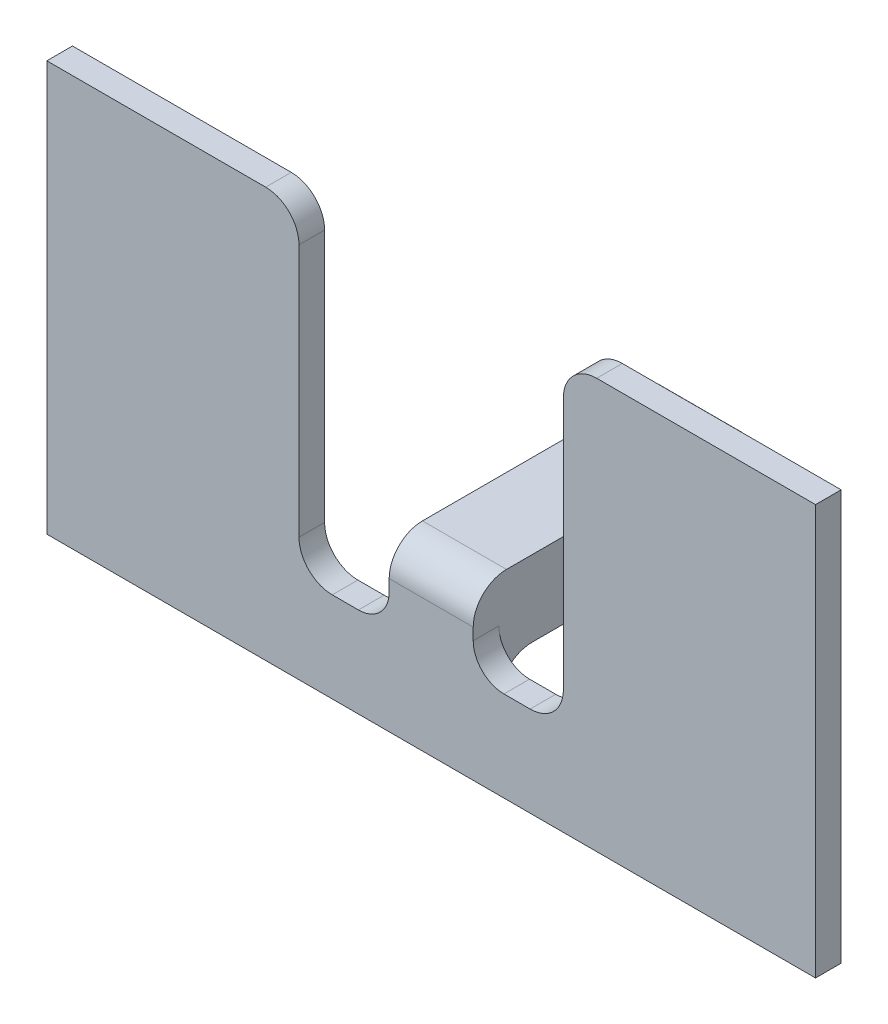
ISO-10303-21;
HEADER;
FILE_DESCRIPTION(('STEP AP214'),'2;1');
FILE_NAME('part.step','',(''),(''),'','','');
FILE_SCHEMA(('AUTOMOTIVE_DESIGN { 1 0 10303 214 1 1 1 1 }'));
ENDSEC;
DATA;
#1=APPLICATION_CONTEXT('core data for automotive mechanical design processes');
#2=APPLICATION_PROTOCOL_DEFINITION('international standard','automotive_design',2000,#1);
#3=PRODUCT_CONTEXT('',#1,'mechanical');
#4=PRODUCT('Part','Part','',(#3));
#5=PRODUCT_RELATED_PRODUCT_CATEGORY('part','',(#4));
#6=PRODUCT_DEFINITION_FORMATION('','',#4);
#7=PRODUCT_DEFINITION_CONTEXT('part definition',#1,'design');
#8=PRODUCT_DEFINITION('design','',#6,#7);
#9=PRODUCT_DEFINITION_SHAPE('','',#8);
#10=(LENGTH_UNIT() NAMED_UNIT(*) SI_UNIT(.MILLI.,.METRE.));
#11=(NAMED_UNIT(*) PLANE_ANGLE_UNIT() SI_UNIT($,.RADIAN.));
#12=(NAMED_UNIT(*) SI_UNIT($,.STERADIAN.) SOLID_ANGLE_UNIT());
#13=UNCERTAINTY_MEASURE_WITH_UNIT(LENGTH_MEASURE(1.E-05),#10,'distance_accuracy_value','');
#14=(GEOMETRIC_REPRESENTATION_CONTEXT(3) GLOBAL_UNCERTAINTY_ASSIGNED_CONTEXT((#13)) GLOBAL_UNIT_ASSIGNED_CONTEXT((#10,
#11,#12)) REPRESENTATION_CONTEXT('',''));
#15=CARTESIAN_POINT('',(0.,0.,0.));
#16=DIRECTION('',(0.,0.,1.));
#17=DIRECTION('',(1.,0.,0.));
#18=AXIS2_PLACEMENT_3D('',#15,#16,#17);
#19=CARTESIAN_POINT('',(-37.5000000000001,20.,2.5));
#20=DIRECTION('',(0.,-1.,0.));
#21=DIRECTION('',(0.,0.,-1.));
#22=AXIS2_PLACEMENT_3D('',#19,#20,#21);
#23=PLANE('',#22);
#24=DIRECTION('',(-1.,0.,0.));
#25=VECTOR('',#24,1.);
#26=CARTESIAN_POINT('',(-37.5000000000001,20.,2.5));
#27=LINE('',#26,#25);
#28=CARTESIAN_POINT('',(-16.15,20.,2.5));
#29=VERTEX_POINT('',#28);
#30=CARTESIAN_POINT('',(-37.5000000000001,20.,2.5));
#31=VERTEX_POINT('',#30);
#32=EDGE_CURVE('E314',#29,#31,#27,.T.);
#33=ORIENTED_EDGE('',*,*,#32,.F.);
#34=DIRECTION('',(0.,0.,-1.));
#35=VECTOR('',#34,1.);
#36=CARTESIAN_POINT('',(-16.15,20.,0.));
#37=LINE('',#36,#35);
#38=CARTESIAN_POINT('',(-16.15,20.,0.));
#39=VERTEX_POINT('',#38);
#40=EDGE_CURVE('E355',#29,#39,#37,.T.);
#41=ORIENTED_EDGE('',*,*,#40,.T.);
#42=DIRECTION('',(-1.,0.,0.));
#43=VECTOR('',#42,1.);
#44=CARTESIAN_POINT('',(-37.5000000000001,20.,0.));
#45=LINE('',#44,#43);
#46=CARTESIAN_POINT('',(-37.5000000000001,20.,0.));
#47=VERTEX_POINT('',#46);
#48=EDGE_CURVE('E330',#39,#47,#45,.T.);
#49=ORIENTED_EDGE('',*,*,#48,.T.);
#50=DIRECTION('',(0.,0.,-1.));
#51=VECTOR('',#50,1.);
#52=CARTESIAN_POINT('',(-37.5000000000001,20.,2.5));
#53=LINE('',#52,#51);
#54=EDGE_CURVE('E347',#31,#47,#53,.T.);
#55=ORIENTED_EDGE('',*,*,#54,.F.);
#56=EDGE_LOOP('',(#33,#41,#49,#55));
#57=FACE_BOUND('',#56,.T.);
#58=ADVANCED_FACE('F49',(#57),#23,.F.);
#59=CARTESIAN_POINT('',(37.5000000000001,-20.,2.5));
#60=DIRECTION('',(-1.,0.,0.));
#61=DIRECTION('',(0.,0.,1.));
#62=AXIS2_PLACEMENT_3D('',#59,#60,#61);
#63=PLANE('',#62);
#64=DIRECTION('',(0.,1.,0.));
#65=VECTOR('',#64,1.);
#66=CARTESIAN_POINT('',(37.5000000000001,-20.,0.));
#67=LINE('',#66,#65);
#68=CARTESIAN_POINT('',(37.5000000000001,-20.,0.));
#69=VERTEX_POINT('',#68);
#70=CARTESIAN_POINT('',(37.5000000000001,20.,0.));
#71=VERTEX_POINT('',#70);
#72=EDGE_CURVE('E309',#69,#71,#67,.T.);
#73=ORIENTED_EDGE('',*,*,#72,.T.);
#74=DIRECTION('',(0.,0.,-1.));
#75=VECTOR('',#74,1.);
#76=CARTESIAN_POINT('',(37.5000000000001,20.,2.5));
#77=LINE('',#76,#75);
#78=CARTESIAN_POINT('',(37.5000000000001,20.,2.5));
#79=VERTEX_POINT('',#78);
#80=EDGE_CURVE('E351',#79,#71,#77,.T.);
#81=ORIENTED_EDGE('',*,*,#80,.F.);
#82=DIRECTION('',(0.,1.,0.));
#83=VECTOR('',#82,1.);
#84=CARTESIAN_POINT('',(37.5000000000001,-20.,2.5));
#85=LINE('',#84,#83);
#86=CARTESIAN_POINT('',(37.5000000000001,-20.,2.5));
#87=VERTEX_POINT('',#86);
#88=EDGE_CURVE('E310',#87,#79,#85,.T.);
#89=ORIENTED_EDGE('',*,*,#88,.F.);
#90=DIRECTION('',(0.,0.,-1.));
#91=VECTOR('',#90,1.);
#92=CARTESIAN_POINT('',(37.5000000000001,-20.,2.5));
#93=LINE('',#92,#91);
#94=EDGE_CURVE('E326',#87,#69,#93,.T.);
#95=ORIENTED_EDGE('',*,*,#94,.T.);
#96=EDGE_LOOP('',(#73,#81,#89,#95));
#97=FACE_BOUND('',#96,.T.);
#98=ADVANCED_FACE('F515',(#97),#63,.F.);
#99=CARTESIAN_POINT('',(16.15,20.,0.));
#100=VERTEX_POINT('',#99);
#101=EDGE_CURVE('E331',#71,#100,#45,.T.);
#102=ORIENTED_EDGE('',*,*,#101,.T.);
#103=DIRECTION('',(0.,0.,-1.));
#104=VECTOR('',#103,1.);
#105=CARTESIAN_POINT('',(16.15,20.,2.5));
#106=LINE('',#105,#104);
#107=CARTESIAN_POINT('',(16.15,20.,2.5));
#108=VERTEX_POINT('',#107);
#109=EDGE_CURVE('E427',#100,#108,#106,.F.);
#110=ORIENTED_EDGE('',*,*,#109,.T.);
#111=EDGE_CURVE('E316',#79,#108,#27,.T.);
#112=ORIENTED_EDGE('',*,*,#111,.F.);
#113=ORIENTED_EDGE('',*,*,#80,.T.);
#114=EDGE_LOOP('',(#102,#110,#112,#113));
#115=FACE_BOUND('',#114,.T.);
#116=ADVANCED_FACE('F572',(#115),#23,.F.);
#117=CARTESIAN_POINT('',(-37.5000000000001,-20.,2.5));
#118=DIRECTION('',(1.,0.,0.));
#119=DIRECTION('',(0.,0.,-1.));
#120=AXIS2_PLACEMENT_3D('',#117,#118,#119);
#121=PLANE('',#120);
#122=DIRECTION('',(0.,-1.,0.));
#123=VECTOR('',#122,1.);
#124=CARTESIAN_POINT('',(-37.5000000000001,-20.,0.));
#125=LINE('',#124,#123);
#126=CARTESIAN_POINT('',(-37.5000000000001,-20.,0.));
#127=VERTEX_POINT('',#126);
#128=EDGE_CURVE('E335',#47,#127,#125,.T.);
#129=ORIENTED_EDGE('',*,*,#128,.T.);
#130=DIRECTION('',(0.,0.,-1.));
#131=VECTOR('',#130,1.);
#132=CARTESIAN_POINT('',(-37.5000000000001,-20.,2.5));
#133=LINE('',#132,#131);
#134=CARTESIAN_POINT('',(-37.5000000000001,-20.,2.5));
#135=VERTEX_POINT('',#134);
#136=EDGE_CURVE('E343',#135,#127,#133,.T.);
#137=ORIENTED_EDGE('',*,*,#136,.F.);
#138=DIRECTION('',(0.,-1.,0.));
#139=VECTOR('',#138,1.);
#140=CARTESIAN_POINT('',(-37.5000000000001,-20.,2.5));
#141=LINE('',#140,#139);
#142=EDGE_CURVE('E320',#31,#135,#141,.T.);
#143=ORIENTED_EDGE('',*,*,#142,.F.);
#144=ORIENTED_EDGE('',*,*,#54,.T.);
#145=EDGE_LOOP('',(#129,#137,#143,#144));
#146=FACE_BOUND('',#145,.T.);
#147=ADVANCED_FACE('F505',(#146),#121,.F.);
#148=CARTESIAN_POINT('',(-37.5000000000001,-20.,2.5));
#149=DIRECTION('',(0.,1.,0.));
#150=DIRECTION('',(0.,0.,1.));
#151=AXIS2_PLACEMENT_3D('',#148,#149,#150);
#152=PLANE('',#151);
#153=DIRECTION('',(1.,0.,0.));
#154=VECTOR('',#153,1.);
#155=CARTESIAN_POINT('',(-37.5000000000001,-20.,0.));
#156=LINE('',#155,#154);
#157=EDGE_CURVE('E315',#127,#69,#156,.T.);
#158=ORIENTED_EDGE('',*,*,#157,.T.);
#159=ORIENTED_EDGE('',*,*,#94,.F.);
#160=DIRECTION('',(1.,0.,0.));
#161=VECTOR('',#160,1.);
#162=CARTESIAN_POINT('',(-37.5000000000001,-20.,2.5));
#163=LINE('',#162,#161);
#164=EDGE_CURVE('E323',#135,#87,#163,.T.);
#165=ORIENTED_EDGE('',*,*,#164,.F.);
#166=ORIENTED_EDGE('',*,*,#136,.T.);
#167=EDGE_LOOP('',(#158,#159,#165,#166));
#168=FACE_BOUND('',#167,.T.);
#169=ADVANCED_FACE('F511',(#168),#152,.F.);
#170=CARTESIAN_POINT('',(0.,0.,2.5));
#171=DIRECTION('',(0.,0.,-1.));
#172=DIRECTION('',(-1.,0.,0.));
#173=AXIS2_PLACEMENT_3D('',#170,#171,#172);
#174=PLANE('',#173);
#175=DIRECTION('',(0.,-1.,0.));
#176=VECTOR('',#175,1.);
#177=CARTESIAN_POINT('',(-12.9,0.,2.5));
#178=LINE('',#177,#176);
#179=CARTESIAN_POINT('',(-12.9,16.75,2.5));
#180=VERTEX_POINT('',#179);
#181=CARTESIAN_POINT('',(-12.9,-7.95,2.5));
#182=VERTEX_POINT('',#181);
#183=EDGE_CURVE('E256',#180,#182,#178,.T.);
#184=ORIENTED_EDGE('',*,*,#183,.F.);
#185=CARTESIAN_POINT('',(-16.15,16.75,2.5));
#186=DIRECTION('',(0.,0.,-1.));
#187=DIRECTION('',(-1.,0.,0.));
#188=AXIS2_PLACEMENT_3D('',#185,#186,#187);
#189=CIRCLE('',#188,3.25);
#190=EDGE_CURVE('E388',#180,#29,#189,.F.);
#191=ORIENTED_EDGE('',*,*,#190,.T.);
#192=ORIENTED_EDGE('',*,*,#32,.T.);
#193=ORIENTED_EDGE('',*,*,#142,.T.);
#194=ORIENTED_EDGE('',*,*,#164,.T.);
#195=ORIENTED_EDGE('',*,*,#88,.T.);
#196=ORIENTED_EDGE('',*,*,#111,.T.);
#197=CARTESIAN_POINT('',(16.15,16.75,2.5));
#198=DIRECTION('',(0.,0.,-1.));
#199=DIRECTION('',(-1.,0.,0.));
#200=AXIS2_PLACEMENT_3D('',#197,#198,#199);
#201=CIRCLE('',#200,3.25);
#202=CARTESIAN_POINT('',(12.9,16.75,2.5));
#203=VERTEX_POINT('',#202);
#204=EDGE_CURVE('E381',#108,#203,#201,.F.);
#205=ORIENTED_EDGE('',*,*,#204,.T.);
#206=DIRECTION('',(0.,-1.,0.));
#207=VECTOR('',#206,1.);
#208=CARTESIAN_POINT('',(12.9,0.,2.5));
#209=LINE('',#208,#207);
#210=CARTESIAN_POINT('',(12.9,-7.95,2.5));
#211=VERTEX_POINT('',#210);
#212=EDGE_CURVE('E292',#203,#211,#209,.T.);
#213=ORIENTED_EDGE('',*,*,#212,.T.);
#214=CARTESIAN_POINT('',(9.65,-7.95,2.5));
#215=DIRECTION('',(0.,0.,-1.));
#216=DIRECTION('',(-1.,0.,0.));
#217=AXIS2_PLACEMENT_3D('',#214,#215,#216);
#218=CIRCLE('',#217,3.25);
#219=CARTESIAN_POINT('',(9.65,-11.2,2.5));
#220=VERTEX_POINT('',#219);
#221=EDGE_CURVE('E448',#211,#220,#218,.T.);
#222=ORIENTED_EDGE('',*,*,#221,.T.);
#223=DIRECTION('',(-1.,0.,0.));
#224=VECTOR('',#223,1.);
#225=CARTESIAN_POINT('',(0.,-11.2,2.5));
#226=LINE('',#225,#224);
#227=CARTESIAN_POINT('',(7.1,-11.2,2.5));
#228=VERTEX_POINT('',#227);
#229=EDGE_CURVE('E296',#220,#228,#226,.T.);
#230=ORIENTED_EDGE('',*,*,#229,.T.);
#231=CARTESIAN_POINT('',(7.1,-8.2,2.5));
#232=DIRECTION('',(0.,0.,-1.));
#233=DIRECTION('',(-1.,0.,0.));
#234=AXIS2_PLACEMENT_3D('',#231,#232,#233);
#235=CIRCLE('',#234,3.);
#236=CARTESIAN_POINT('',(4.1,-8.2,2.5));
#237=VERTEX_POINT('',#236);
#238=EDGE_CURVE('E467',#228,#237,#235,.T.);
#239=ORIENTED_EDGE('',*,*,#238,.T.);
#240=DIRECTION('',(0.,1.,0.));
#241=VECTOR('',#240,1.);
#242=CARTESIAN_POINT('',(4.1,0.,2.5));
#243=LINE('',#242,#241);
#244=CARTESIAN_POINT('',(4.1,-7.05,2.5));
#245=VERTEX_POINT('',#244);
#246=EDGE_CURVE('E300',#237,#245,#243,.T.);
#247=ORIENTED_EDGE('',*,*,#246,.T.);
#248=DIRECTION('',(-1.,0.,0.));
#249=VECTOR('',#248,1.);
#250=CARTESIAN_POINT('',(0.,-7.05,2.5));
#251=LINE('',#250,#249);
#252=CARTESIAN_POINT('',(-4.1,-7.05,2.5));
#253=VERTEX_POINT('',#252);
#254=EDGE_CURVE('E384',#245,#253,#251,.T.);
#255=ORIENTED_EDGE('',*,*,#254,.T.);
#256=DIRECTION('',(0.,1.,0.));
#257=VECTOR('',#256,1.);
#258=CARTESIAN_POINT('',(-4.1,0.,2.5));
#259=LINE('',#258,#257);
#260=CARTESIAN_POINT('',(-4.1,-8.2,2.5));
#261=VERTEX_POINT('',#260);
#262=EDGE_CURVE('E303',#261,#253,#259,.T.);
#263=ORIENTED_EDGE('',*,*,#262,.F.);
#264=CARTESIAN_POINT('',(-7.1,-8.2,2.5));
#265=DIRECTION('',(0.,0.,-1.));
#266=DIRECTION('',(-1.,0.,0.));
#267=AXIS2_PLACEMENT_3D('',#264,#265,#266);
#268=CIRCLE('',#267,3.);
#269=CARTESIAN_POINT('',(-7.1,-11.2,2.5));
#270=VERTEX_POINT('',#269);
#271=EDGE_CURVE('E11',#261,#270,#268,.T.);
#272=ORIENTED_EDGE('',*,*,#271,.T.);
#273=DIRECTION('',(-1.,0.,0.));
#274=VECTOR('',#273,1.);
#275=CARTESIAN_POINT('',(0.,-11.2,2.5));
#276=LINE('',#275,#274);
#277=CARTESIAN_POINT('',(-9.65,-11.2,2.5));
#278=VERTEX_POINT('',#277);
#279=EDGE_CURVE('E306',#270,#278,#276,.T.);
#280=ORIENTED_EDGE('',*,*,#279,.T.);
#281=CARTESIAN_POINT('',(-9.65,-7.95,2.5));
#282=DIRECTION('',(0.,0.,-1.));
#283=DIRECTION('',(-1.,0.,0.));
#284=AXIS2_PLACEMENT_3D('',#281,#282,#283);
#285=CIRCLE('',#284,3.25);
#286=EDGE_CURVE('E436',#278,#182,#285,.T.);
#287=ORIENTED_EDGE('',*,*,#286,.T.);
#288=EDGE_LOOP('',(#184,#191,#192,#193,#194,#195,#196,#205,#213,#222,#230,#239,#247,#255,#263,
#272,#280,#287));
#289=FACE_BOUND('',#288,.T.);
#290=ADVANCED_FACE('F481',(#289),#174,.F.);
#291=CARTESIAN_POINT('',(0.,0.,0.));
#292=DIRECTION('',(0.,0.,-1.));
#293=DIRECTION('',(-1.,0.,0.));
#294=AXIS2_PLACEMENT_3D('',#291,#292,#293);
#295=PLANE('',#294);
#296=ORIENTED_EDGE('',*,*,#48,.F.);
#297=CARTESIAN_POINT('',(-16.15,16.75,0.));
#298=DIRECTION('',(0.,0.,-1.));
#299=DIRECTION('',(-1.,0.,0.));
#300=AXIS2_PLACEMENT_3D('',#297,#298,#299);
#301=CIRCLE('',#300,3.25);
#302=CARTESIAN_POINT('',(-12.9,16.75,0.));
#303=VERTEX_POINT('',#302);
#304=EDGE_CURVE('E371',#39,#303,#301,.T.);
#305=ORIENTED_EDGE('',*,*,#304,.T.);
#306=DIRECTION('',(0.,-1.,0.));
#307=VECTOR('',#306,1.);
#308=CARTESIAN_POINT('',(-12.9,0.,0.));
#309=LINE('',#308,#307);
#310=CARTESIAN_POINT('',(-12.9,-7.95,0.));
#311=VERTEX_POINT('',#310);
#312=EDGE_CURVE('E283',#303,#311,#309,.T.);
#313=ORIENTED_EDGE('',*,*,#312,.T.);
#314=CARTESIAN_POINT('',(-9.65,-7.95,0.));
#315=DIRECTION('',(0.,0.,-1.));
#316=DIRECTION('',(-1.,0.,0.));
#317=AXIS2_PLACEMENT_3D('',#314,#315,#316);
#318=CIRCLE('',#317,3.25);
#319=CARTESIAN_POINT('',(-9.65,-11.2,0.));
#320=VERTEX_POINT('',#319);
#321=EDGE_CURVE('E432',#311,#320,#318,.F.);
#322=ORIENTED_EDGE('',*,*,#321,.T.);
#323=DIRECTION('',(-1.,0.,0.));
#324=VECTOR('',#323,1.);
#325=CARTESIAN_POINT('',(0.,-11.2,0.));
#326=LINE('',#325,#324);
#327=CARTESIAN_POINT('',(-7.1,-11.2,0.));
#328=VERTEX_POINT('',#327);
#329=EDGE_CURVE('E245',#328,#320,#326,.T.);
#330=ORIENTED_EDGE('',*,*,#329,.F.);
#331=CARTESIAN_POINT('',(-7.1,-8.2,0.));
#332=DIRECTION('',(0.,0.,-1.));
#333=DIRECTION('',(-1.,0.,0.));
#334=AXIS2_PLACEMENT_3D('',#331,#332,#333);
#335=CIRCLE('',#334,3.);
#336=CARTESIAN_POINT('',(-4.1,-8.2,0.));
#337=VERTEX_POINT('',#336);
#338=EDGE_CURVE('E58',#328,#337,#335,.F.);
#339=ORIENTED_EDGE('',*,*,#338,.T.);
#340=DIRECTION('',(0.,-1.,0.));
#341=VECTOR('',#340,1.);
#342=CARTESIAN_POINT('',(-4.1,0.,0.));
#343=LINE('',#342,#341);
#344=CARTESIAN_POINT('',(-4.1,-14.45,0.));
#345=VERTEX_POINT('',#344);
#346=EDGE_CURVE('E65',#337,#345,#343,.T.);
#347=ORIENTED_EDGE('',*,*,#346,.T.);
#348=DIRECTION('',(-1.,0.,0.));
#349=VECTOR('',#348,1.);
#350=CARTESIAN_POINT('',(0.,-14.45,0.));
#351=LINE('',#350,#349);
#352=CARTESIAN_POINT('',(4.1,-14.45,0.));
#353=VERTEX_POINT('',#352);
#354=EDGE_CURVE('E365',#345,#353,#351,.F.);
#355=ORIENTED_EDGE('',*,*,#354,.T.);
#356=DIRECTION('',(0.,1.,0.));
#357=VECTOR('',#356,1.);
#358=CARTESIAN_POINT('',(4.1,0.,0.));
#359=LINE('',#358,#357);
#360=CARTESIAN_POINT('',(4.1,-8.2,0.));
#361=VERTEX_POINT('',#360);
#362=EDGE_CURVE('E362',#353,#361,#359,.T.);
#363=ORIENTED_EDGE('',*,*,#362,.T.);
#364=CARTESIAN_POINT('',(7.1,-8.2,0.));
#365=DIRECTION('',(0.,0.,-1.));
#366=DIRECTION('',(-1.,0.,0.));
#367=AXIS2_PLACEMENT_3D('',#364,#365,#366);
#368=CIRCLE('',#367,3.);
#369=CARTESIAN_POINT('',(7.1,-11.2,0.));
#370=VERTEX_POINT('',#369);
#371=EDGE_CURVE('E464',#361,#370,#368,.F.);
#372=ORIENTED_EDGE('',*,*,#371,.T.);
#373=CARTESIAN_POINT('',(9.65,-11.2,0.));
#374=VERTEX_POINT('',#373);
#375=EDGE_CURVE('E278',#374,#370,#326,.T.);
#376=ORIENTED_EDGE('',*,*,#375,.F.);
#377=CARTESIAN_POINT('',(9.65,-7.95,0.));
#378=DIRECTION('',(0.,0.,-1.));
#379=DIRECTION('',(-1.,0.,0.));
#380=AXIS2_PLACEMENT_3D('',#377,#378,#379);
#381=CIRCLE('',#380,3.25);
#382=CARTESIAN_POINT('',(12.9,-7.95,0.));
#383=VERTEX_POINT('',#382);
#384=EDGE_CURVE('E445',#374,#383,#381,.F.);
#385=ORIENTED_EDGE('',*,*,#384,.T.);
#386=DIRECTION('',(0.,-1.,0.));
#387=VECTOR('',#386,1.);
#388=CARTESIAN_POINT('',(12.9,0.,0.));
#389=LINE('',#388,#387);
#390=CARTESIAN_POINT('',(12.9,16.75,0.));
#391=VERTEX_POINT('',#390);
#392=EDGE_CURVE('E279',#391,#383,#389,.T.);
#393=ORIENTED_EDGE('',*,*,#392,.F.);
#394=CARTESIAN_POINT('',(16.15,16.75,0.));
#395=DIRECTION('',(0.,0.,-1.));
#396=DIRECTION('',(-1.,0.,0.));
#397=AXIS2_PLACEMENT_3D('',#394,#395,#396);
#398=CIRCLE('',#397,3.25);
#399=EDGE_CURVE('E359',#391,#100,#398,.T.);
#400=ORIENTED_EDGE('',*,*,#399,.T.);
#401=ORIENTED_EDGE('',*,*,#101,.F.);
#402=ORIENTED_EDGE('',*,*,#72,.F.);
#403=ORIENTED_EDGE('',*,*,#157,.F.);
#404=ORIENTED_EDGE('',*,*,#128,.F.);
#405=EDGE_LOOP('',(#296,#305,#313,#322,#330,#339,#347,#355,#363,#372,#376,#385,#393,#400,#401,
#402,#403,#404));
#406=FACE_BOUND('',#405,.T.);
#407=ADVANCED_FACE('F473',(#406),#295,.T.);
#408=CARTESIAN_POINT('',(0.,-11.2,10.));
#409=DIRECTION('',(0.,-1.,0.));
#410=DIRECTION('',(0.,0.,-1.));
#411=AXIS2_PLACEMENT_3D('',#408,#409,#410);
#412=PLANE('',#411);
#413=ORIENTED_EDGE('',*,*,#279,.F.);
#414=DIRECTION('',(0.,0.,-1.));
#415=VECTOR('',#414,1.);
#416=CARTESIAN_POINT('',(-7.1,-11.2,10.));
#417=LINE('',#416,#415);
#418=EDGE_CURVE('E458',#270,#328,#417,.T.);
#419=ORIENTED_EDGE('',*,*,#418,.T.);
#420=ORIENTED_EDGE('',*,*,#329,.T.);
#421=DIRECTION('',(0.,0.,-1.));
#422=VECTOR('',#421,1.);
#423=CARTESIAN_POINT('',(-9.65,-11.2,10.));
#424=LINE('',#423,#422);
#425=EDGE_CURVE('E391',#320,#278,#424,.F.);
#426=ORIENTED_EDGE('',*,*,#425,.T.);
#427=EDGE_LOOP('',(#413,#419,#420,#426));
#428=FACE_BOUND('',#427,.T.);
#429=ADVANCED_FACE('F483',(#428),#412,.F.);
#430=CARTESIAN_POINT('',(-4.1,0.,10.));
#431=DIRECTION('',(-1.,0.,0.));
#432=DIRECTION('',(0.,0.,1.));
#433=AXIS2_PLACEMENT_3D('',#430,#431,#432);
#434=PLANE('',#433);
#435=ORIENTED_EDGE('',*,*,#346,.F.);
#436=DIRECTION('',(0.,0.,-1.));
#437=VECTOR('',#436,1.);
#438=CARTESIAN_POINT('',(-4.1,-8.2,10.));
#439=LINE('',#438,#437);
#440=EDGE_CURVE('E70',#337,#261,#439,.F.);
#441=ORIENTED_EDGE('',*,*,#440,.T.);
#442=ORIENTED_EDGE('',*,*,#262,.T.);
#443=CARTESIAN_POINT('',(-4.1,-7.05,-0.75));
#444=DIRECTION('',(-1.,0.,0.));
#445=DIRECTION('',(0.,0.,1.));
#446=AXIS2_PLACEMENT_3D('',#443,#444,#445);
#447=CIRCLE('',#446,3.25);
#448=CARTESIAN_POINT('',(-4.1,-3.8,-0.749999999999999));
#449=VERTEX_POINT('',#448);
#450=EDGE_CURVE('E252',#253,#449,#447,.T.);
#451=ORIENTED_EDGE('',*,*,#450,.T.);
#452=DIRECTION('',(0.,0.,-1.));
#453=VECTOR('',#452,1.);
#454=CARTESIAN_POINT('',(-4.1,-3.8,10.));
#455=LINE('',#454,#453);
#456=CARTESIAN_POINT('',(-4.1,-3.8,-23.8139999999998));
#457=VERTEX_POINT('',#456);
#458=EDGE_CURVE('E249',#449,#457,#455,.T.);
#459=ORIENTED_EDGE('',*,*,#458,.T.);
#460=DIRECTION('',(0.,1.,0.));
#461=VECTOR('',#460,1.);
#462=CARTESIAN_POINT('',(-4.1,0.,-23.8139999999998));
#463=LINE('',#462,#461);
#464=CARTESIAN_POINT('',(-4.1,-7.95,-23.8139999999998));
#465=VERTEX_POINT('',#464);
#466=EDGE_CURVE('E236',#465,#457,#463,.T.);
#467=ORIENTED_EDGE('',*,*,#466,.F.);
#468=CARTESIAN_POINT('',(-4.1,-7.95,-20.5639999999998));
#469=DIRECTION('',(-1.,0.,0.));
#470=DIRECTION('',(0.,0.,1.));
#471=AXIS2_PLACEMENT_3D('',#468,#469,#470);
#472=CIRCLE('',#471,3.25);
#473=CARTESIAN_POINT('',(-4.1,-11.2,-20.5639999999998));
#474=VERTEX_POINT('',#473);
#475=EDGE_CURVE('E395',#465,#474,#472,.T.);
#476=ORIENTED_EDGE('',*,*,#475,.T.);
#477=DIRECTION('',(0.,0.,1.));
#478=VECTOR('',#477,1.);
#479=CARTESIAN_POINT('',(-4.1,-11.2,-34.8593610171871));
#480=LINE('',#479,#478);
#481=CARTESIAN_POINT('',(-4.1,-11.2,-3.25));
#482=VERTEX_POINT('',#481);
#483=EDGE_CURVE('E264',#474,#482,#480,.T.);
#484=ORIENTED_EDGE('',*,*,#483,.T.);
#485=CARTESIAN_POINT('',(-4.1,-14.45,-3.25));
#486=DIRECTION('',(-1.,0.,0.));
#487=DIRECTION('',(0.,0.,1.));
#488=AXIS2_PLACEMENT_3D('',#485,#486,#487);
#489=CIRCLE('',#488,3.25);
#490=EDGE_CURVE('E439',#482,#345,#489,.F.);
#491=ORIENTED_EDGE('',*,*,#490,.T.);
#492=EDGE_LOOP('',(#435,#441,#442,#451,#459,#467,#476,#484,#491));
#493=FACE_BOUND('',#492,.T.);
#494=ADVANCED_FACE('F250',(#493),#434,.T.);
#495=CARTESIAN_POINT('',(0.,-3.8,10.));
#496=DIRECTION('',(0.,-1.,0.));
#497=DIRECTION('',(0.,0.,-1.));
#498=AXIS2_PLACEMENT_3D('',#495,#496,#497);
#499=PLANE('',#498);
#500=ORIENTED_EDGE('',*,*,#458,.F.);
#501=DIRECTION('',(-1.,0.,0.));
#502=VECTOR('',#501,1.);
#503=CARTESIAN_POINT('',(0.,-3.8,-0.749999999999999));
#504=LINE('',#503,#502);
#505=CARTESIAN_POINT('',(4.1,-3.8,-0.749999999999999));
#506=VERTEX_POINT('',#505);
#507=EDGE_CURVE('E400',#449,#506,#504,.F.);
#508=ORIENTED_EDGE('',*,*,#507,.T.);
#509=DIRECTION('',(0.,0.,-1.));
#510=VECTOR('',#509,1.);
#511=CARTESIAN_POINT('',(4.1,-3.8,10.));
#512=LINE('',#511,#510);
#513=CARTESIAN_POINT('',(4.1,-3.8,-23.8139999999998));
#514=VERTEX_POINT('',#513);
#515=EDGE_CURVE('E257',#506,#514,#512,.T.);
#516=ORIENTED_EDGE('',*,*,#515,.T.);
#517=DIRECTION('',(-1.,0.,0.));
#518=VECTOR('',#517,1.);
#519=CARTESIAN_POINT('',(0.,-3.8,-23.8139999999998));
#520=LINE('',#519,#518);
#521=EDGE_CURVE('E241',#514,#457,#520,.T.);
#522=ORIENTED_EDGE('',*,*,#521,.T.);
#523=EDGE_LOOP('',(#500,#508,#516,#522));
#524=FACE_BOUND('',#523,.T.);
#525=ADVANCED_FACE('F260',(#524),#499,.F.);
#526=CARTESIAN_POINT('',(4.1,0.,10.));
#527=DIRECTION('',(-1.,0.,0.));
#528=DIRECTION('',(0.,0.,1.));
#529=AXIS2_PLACEMENT_3D('',#526,#527,#528);
#530=PLANE('',#529);
#531=ORIENTED_EDGE('',*,*,#246,.F.);
#532=DIRECTION('',(0.,0.,-1.));
#533=VECTOR('',#532,1.);
#534=CARTESIAN_POINT('',(4.1,-8.2,0.));
#535=LINE('',#534,#533);
#536=EDGE_CURVE('E451',#237,#361,#535,.T.);
#537=ORIENTED_EDGE('',*,*,#536,.T.);
#538=ORIENTED_EDGE('',*,*,#362,.F.);
#539=CARTESIAN_POINT('',(4.1,-14.45,-3.25));
#540=DIRECTION('',(-1.,0.,0.));
#541=DIRECTION('',(0.,0.,1.));
#542=AXIS2_PLACEMENT_3D('',#539,#540,#541);
#543=CIRCLE('',#542,3.25);
#544=CARTESIAN_POINT('',(4.1,-11.2,-3.25));
#545=VERTEX_POINT('',#544);
#546=EDGE_CURVE('E442',#353,#545,#543,.T.);
#547=ORIENTED_EDGE('',*,*,#546,.T.);
#548=DIRECTION('',(0.,0.,1.));
#549=VECTOR('',#548,1.);
#550=CARTESIAN_POINT('',(4.1,-11.2,-34.8593610171871));
#551=LINE('',#550,#549);
#552=CARTESIAN_POINT('',(4.1,-11.2,-20.5639999999998));
#553=VERTEX_POINT('',#552);
#554=EDGE_CURVE('E246',#553,#545,#551,.T.);
#555=ORIENTED_EDGE('',*,*,#554,.F.);
#556=CARTESIAN_POINT('',(4.1,-7.95,-20.5639999999998));
#557=DIRECTION('',(-1.,0.,0.));
#558=DIRECTION('',(0.,0.,1.));
#559=AXIS2_PLACEMENT_3D('',#556,#557,#558);
#560=CIRCLE('',#559,3.25);
#561=CARTESIAN_POINT('',(4.1,-7.95,-23.8139999999998));
#562=VERTEX_POINT('',#561);
#563=EDGE_CURVE('E403',#553,#562,#560,.F.);
#564=ORIENTED_EDGE('',*,*,#563,.T.);
#565=DIRECTION('',(0.,1.,0.));
#566=VECTOR('',#565,1.);
#567=CARTESIAN_POINT('',(4.1,0.,-23.8139999999998));
#568=LINE('',#567,#566);
#569=EDGE_CURVE('E263',#562,#514,#568,.T.);
#570=ORIENTED_EDGE('',*,*,#569,.T.);
#571=ORIENTED_EDGE('',*,*,#515,.F.);
#572=CARTESIAN_POINT('',(4.1,-7.05,-0.75));
#573=DIRECTION('',(-1.,0.,0.));
#574=DIRECTION('',(0.,0.,1.));
#575=AXIS2_PLACEMENT_3D('',#572,#573,#574);
#576=CIRCLE('',#575,3.25);
#577=EDGE_CURVE('E405',#506,#245,#576,.F.);
#578=ORIENTED_EDGE('',*,*,#577,.T.);
#579=EDGE_LOOP('',(#531,#537,#538,#547,#555,#564,#570,#571,#578));
#580=FACE_BOUND('',#579,.T.);
#581=ADVANCED_FACE('F545',(#580),#530,.F.);
#582=ORIENTED_EDGE('',*,*,#375,.T.);
#583=DIRECTION('',(0.,0.,-1.));
#584=VECTOR('',#583,1.);
#585=CARTESIAN_POINT('',(7.1,-11.2,2.5));
#586=LINE('',#585,#584);
#587=EDGE_CURVE('E455',#370,#228,#586,.F.);
#588=ORIENTED_EDGE('',*,*,#587,.T.);
#589=ORIENTED_EDGE('',*,*,#229,.F.);
#590=DIRECTION('',(0.,0.,-1.));
#591=VECTOR('',#590,1.);
#592=CARTESIAN_POINT('',(9.65,-11.2,0.));
#593=LINE('',#592,#591);
#594=EDGE_CURVE('E416',#220,#374,#593,.T.);
#595=ORIENTED_EDGE('',*,*,#594,.T.);
#596=EDGE_LOOP('',(#582,#588,#589,#595));
#597=FACE_BOUND('',#596,.T.);
#598=ADVANCED_FACE('F536',(#597),#412,.F.);
#599=CARTESIAN_POINT('',(12.9,0.,10.));
#600=DIRECTION('',(1.,0.,0.));
#601=DIRECTION('',(0.,0.,-1.));
#602=AXIS2_PLACEMENT_3D('',#599,#600,#601);
#603=PLANE('',#602);
#604=ORIENTED_EDGE('',*,*,#392,.T.);
#605=DIRECTION('',(0.,0.,-1.));
#606=VECTOR('',#605,1.);
#607=CARTESIAN_POINT('',(12.9,-7.95,2.5));
#608=LINE('',#607,#606);
#609=EDGE_CURVE('E424',#383,#211,#608,.F.);
#610=ORIENTED_EDGE('',*,*,#609,.T.);
#611=ORIENTED_EDGE('',*,*,#212,.F.);
#612=DIRECTION('',(0.,0.,-1.));
#613=VECTOR('',#612,1.);
#614=CARTESIAN_POINT('',(12.9,16.75,10.));
#615=LINE('',#614,#613);
#616=EDGE_CURVE('E420',#203,#391,#615,.T.);
#617=ORIENTED_EDGE('',*,*,#616,.T.);
#618=EDGE_LOOP('',(#604,#610,#611,#617));
#619=FACE_BOUND('',#618,.T.);
#620=ADVANCED_FACE('F526',(#619),#603,.F.);
#621=CARTESIAN_POINT('',(-12.9,0.,10.));
#622=DIRECTION('',(1.,0.,0.));
#623=DIRECTION('',(0.,0.,-1.));
#624=AXIS2_PLACEMENT_3D('',#621,#622,#623);
#625=PLANE('',#624);
#626=ORIENTED_EDGE('',*,*,#312,.F.);
#627=DIRECTION('',(0.,0.,-1.));
#628=VECTOR('',#627,1.);
#629=CARTESIAN_POINT('',(-12.9,16.75,2.5));
#630=LINE('',#629,#628);
#631=EDGE_CURVE('E378',#303,#180,#630,.F.);
#632=ORIENTED_EDGE('',*,*,#631,.T.);
#633=ORIENTED_EDGE('',*,*,#183,.T.);
#634=DIRECTION('',(0.,0.,-1.));
#635=VECTOR('',#634,1.);
#636=CARTESIAN_POINT('',(-12.9,-7.95,10.));
#637=LINE('',#636,#635);
#638=EDGE_CURVE('E374',#182,#311,#637,.T.);
#639=ORIENTED_EDGE('',*,*,#638,.T.);
#640=EDGE_LOOP('',(#626,#632,#633,#639));
#641=FACE_BOUND('',#640,.T.);
#642=ADVANCED_FACE('F492',(#641),#625,.T.);
#643=CARTESIAN_POINT('',(0.,-11.2,-34.8593610171871));
#644=DIRECTION('',(0.,1.,0.));
#645=DIRECTION('',(0.,0.,1.));
#646=AXIS2_PLACEMENT_3D('',#643,#644,#645);
#647=PLANE('',#646);
#648=ORIENTED_EDGE('',*,*,#554,.T.);
#649=DIRECTION('',(-1.,0.,0.));
#650=VECTOR('',#649,1.);
#651=CARTESIAN_POINT('',(0.,-11.2,-3.25));
#652=LINE('',#651,#650);
#653=EDGE_CURVE('E412',#545,#482,#652,.T.);
#654=ORIENTED_EDGE('',*,*,#653,.T.);
#655=ORIENTED_EDGE('',*,*,#483,.F.);
#656=DIRECTION('',(-1.,0.,0.));
#657=VECTOR('',#656,1.);
#658=CARTESIAN_POINT('',(4.1,-11.2,-20.5639999999998));
#659=LINE('',#658,#657);
#660=EDGE_CURVE('E409',#474,#553,#659,.F.);
#661=ORIENTED_EDGE('',*,*,#660,.T.);
#662=EDGE_LOOP('',(#648,#654,#655,#661));
#663=FACE_BOUND('',#662,.T.);
#664=ADVANCED_FACE('F557',(#663),#647,.F.);
#665=CARTESIAN_POINT('',(10.4,-3.19999999999993,-23.8139999999998));
#666=DIRECTION('',(0.,0.,-1.));
#667=DIRECTION('',(-1.,0.,0.));
#668=AXIS2_PLACEMENT_3D('',#665,#666,#667);
#669=PLANE('',#668);
#670=ORIENTED_EDGE('',*,*,#569,.F.);
#671=DIRECTION('',(-1.,0.,0.));
#672=VECTOR('',#671,1.);
#673=CARTESIAN_POINT('',(-4.1,-7.95,-23.8139999999998));
#674=LINE('',#673,#672);
#675=EDGE_CURVE('E243',#562,#465,#674,.T.);
#676=ORIENTED_EDGE('',*,*,#675,.T.);
#677=ORIENTED_EDGE('',*,*,#466,.T.);
#678=ORIENTED_EDGE('',*,*,#521,.F.);
#679=EDGE_LOOP('',(#670,#676,#677,#678));
#680=FACE_BOUND('',#679,.T.);
#681=ADVANCED_FACE('F239',(#680),#669,.T.);
#682=CARTESIAN_POINT('',(-16.15,16.75,2.5));
#683=DIRECTION('',(0.,0.,1.));
#684=DIRECTION('',(1.,0.,0.));
#685=AXIS2_PLACEMENT_3D('',#682,#683,#684);
#686=CYLINDRICAL_SURFACE('',#685,3.25);
#687=ORIENTED_EDGE('',*,*,#190,.F.);
#688=ORIENTED_EDGE('',*,*,#631,.F.);
#689=ORIENTED_EDGE('',*,*,#304,.F.);
#690=ORIENTED_EDGE('',*,*,#40,.F.);
#691=EDGE_LOOP('',(#687,#688,#689,#690));
#692=FACE_BOUND('',#691,.T.);
#693=ADVANCED_FACE('F495',(#692),#686,.T.);
#694=CARTESIAN_POINT('',(-9.65,-7.95,10.));
#695=DIRECTION('',(0.,0.,-1.));
#696=DIRECTION('',(-1.,0.,0.));
#697=AXIS2_PLACEMENT_3D('',#694,#695,#696);
#698=CYLINDRICAL_SURFACE('',#697,3.25);
#699=ORIENTED_EDGE('',*,*,#286,.F.);
#700=ORIENTED_EDGE('',*,*,#425,.F.);
#701=ORIENTED_EDGE('',*,*,#321,.F.);
#702=ORIENTED_EDGE('',*,*,#638,.F.);
#703=EDGE_LOOP('',(#699,#700,#701,#702));
#704=FACE_BOUND('',#703,.T.);
#705=ADVANCED_FACE('F488',(#704),#698,.F.);
#706=CARTESIAN_POINT('',(0.,-7.05,-0.75));
#707=DIRECTION('',(-1.,0.,0.));
#708=DIRECTION('',(0.,0.,1.));
#709=AXIS2_PLACEMENT_3D('',#706,#707,#708);
#710=CYLINDRICAL_SURFACE('',#709,3.25);
#711=ORIENTED_EDGE('',*,*,#577,.F.);
#712=ORIENTED_EDGE('',*,*,#507,.F.);
#713=ORIENTED_EDGE('',*,*,#450,.F.);
#714=ORIENTED_EDGE('',*,*,#254,.F.);
#715=EDGE_LOOP('',(#711,#712,#713,#714));
#716=FACE_BOUND('',#715,.T.);
#717=ADVANCED_FACE('F549',(#716),#710,.T.);
#718=CARTESIAN_POINT('',(0.,-14.45,-3.25));
#719=DIRECTION('',(-1.,0.,0.));
#720=DIRECTION('',(0.,0.,1.));
#721=AXIS2_PLACEMENT_3D('',#718,#719,#720);
#722=CYLINDRICAL_SURFACE('',#721,3.25);
#723=ORIENTED_EDGE('',*,*,#546,.F.);
#724=ORIENTED_EDGE('',*,*,#354,.F.);
#725=ORIENTED_EDGE('',*,*,#490,.F.);
#726=ORIENTED_EDGE('',*,*,#653,.F.);
#727=EDGE_LOOP('',(#723,#724,#725,#726));
#728=FACE_BOUND('',#727,.T.);
#729=ADVANCED_FACE('F561',(#728),#722,.F.);
#730=CARTESIAN_POINT('',(9.65,-7.95,10.));
#731=DIRECTION('',(0.,0.,1.));
#732=DIRECTION('',(1.,0.,0.));
#733=AXIS2_PLACEMENT_3D('',#730,#731,#732);
#734=CYLINDRICAL_SURFACE('',#733,3.25);
#735=ORIENTED_EDGE('',*,*,#221,.F.);
#736=ORIENTED_EDGE('',*,*,#609,.F.);
#737=ORIENTED_EDGE('',*,*,#384,.F.);
#738=ORIENTED_EDGE('',*,*,#594,.F.);
#739=EDGE_LOOP('',(#735,#736,#737,#738));
#740=FACE_BOUND('',#739,.T.);
#741=ADVANCED_FACE('F533',(#740),#734,.F.);
#742=CARTESIAN_POINT('',(16.15,16.75,10.));
#743=DIRECTION('',(0.,0.,-1.));
#744=DIRECTION('',(-1.,0.,0.));
#745=AXIS2_PLACEMENT_3D('',#742,#743,#744);
#746=CYLINDRICAL_SURFACE('',#745,3.25);
#747=ORIENTED_EDGE('',*,*,#204,.F.);
#748=ORIENTED_EDGE('',*,*,#109,.F.);
#749=ORIENTED_EDGE('',*,*,#399,.F.);
#750=ORIENTED_EDGE('',*,*,#616,.F.);
#751=EDGE_LOOP('',(#747,#748,#749,#750));
#752=FACE_BOUND('',#751,.T.);
#753=ADVANCED_FACE('F523',(#752),#746,.T.);
#754=CARTESIAN_POINT('',(10.4,-7.95,-20.5639999999998));
#755=DIRECTION('',(1.,0.,0.));
#756=DIRECTION('',(0.,0.,-1.));
#757=AXIS2_PLACEMENT_3D('',#754,#755,#756);
#758=CYLINDRICAL_SURFACE('',#757,3.25);
#759=ORIENTED_EDGE('',*,*,#563,.F.);
#760=ORIENTED_EDGE('',*,*,#660,.F.);
#761=ORIENTED_EDGE('',*,*,#475,.F.);
#762=ORIENTED_EDGE('',*,*,#675,.F.);
#763=EDGE_LOOP('',(#759,#760,#761,#762));
#764=FACE_BOUND('',#763,.T.);
#765=ADVANCED_FACE('F553',(#764),#758,.T.);
#766=CARTESIAN_POINT('',(7.1,-8.2,10.));
#767=DIRECTION('',(0.,0.,1.));
#768=DIRECTION('',(1.,0.,0.));
#769=AXIS2_PLACEMENT_3D('',#766,#767,#768);
#770=CYLINDRICAL_SURFACE('',#769,3.);
#771=ORIENTED_EDGE('',*,*,#238,.F.);
#772=ORIENTED_EDGE('',*,*,#587,.F.);
#773=ORIENTED_EDGE('',*,*,#371,.F.);
#774=ORIENTED_EDGE('',*,*,#536,.F.);
#775=EDGE_LOOP('',(#771,#772,#773,#774));
#776=FACE_BOUND('',#775,.T.);
#777=ADVANCED_FACE('F542',(#776),#770,.F.);
#778=CARTESIAN_POINT('',(-7.1,-8.2,10.));
#779=DIRECTION('',(0.,0.,-1.));
#780=DIRECTION('',(-1.,0.,0.));
#781=AXIS2_PLACEMENT_3D('',#778,#779,#780);
#782=CYLINDRICAL_SURFACE('',#781,3.);
#783=ORIENTED_EDGE('',*,*,#271,.F.);
#784=ORIENTED_EDGE('',*,*,#440,.F.);
#785=ORIENTED_EDGE('',*,*,#338,.F.);
#786=ORIENTED_EDGE('',*,*,#418,.F.);
#787=EDGE_LOOP('',(#783,#784,#785,#786));
#788=FACE_BOUND('',#787,.T.);
#789=ADVANCED_FACE('F51',(#788),#782,.F.);
#790=CLOSED_SHELL('',(#58,#98,#116,#147,#169,#290,#407,#429,#494,#525,#581,#598,#620,#642,#664,
#681,#693,#705,#717,#729,#741,#753,#765,#777,#789));
#791=MANIFOLD_SOLID_BREP('B2',#790);
#792=ADVANCED_BREP_SHAPE_REPRESENTATION('',(#18,#791),#14);
#793=SHAPE_DEFINITION_REPRESENTATION(#9,#792);
ENDSEC;
END-ISO-10303-21;
